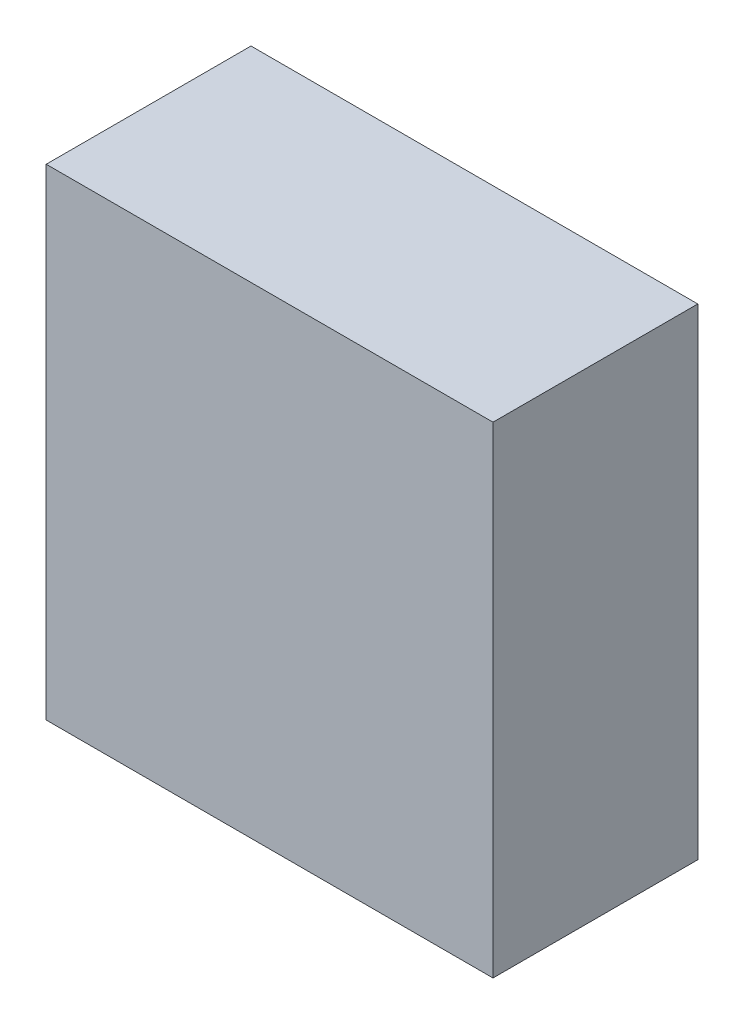
ISO-10303-21;
HEADER;
FILE_DESCRIPTION(('STEP AP214'),'2;1');
FILE_NAME('part.step','',(''),(''),'','','');
FILE_SCHEMA(('AUTOMOTIVE_DESIGN { 1 0 10303 214 1 1 1 1 }'));
ENDSEC;
DATA;
#1=APPLICATION_CONTEXT('core data for automotive mechanical design processes');
#2=APPLICATION_PROTOCOL_DEFINITION('international standard','automotive_design',2000,#1);
#3=PRODUCT_CONTEXT('',#1,'mechanical');
#4=PRODUCT('Part','Part','',(#3));
#5=PRODUCT_RELATED_PRODUCT_CATEGORY('part','',(#4));
#6=PRODUCT_DEFINITION_FORMATION('','',#4);
#7=PRODUCT_DEFINITION_CONTEXT('part definition',#1,'design');
#8=PRODUCT_DEFINITION('design','',#6,#7);
#9=PRODUCT_DEFINITION_SHAPE('','',#8);
#10=(LENGTH_UNIT() NAMED_UNIT(*) SI_UNIT(.MILLI.,.METRE.));
#11=(NAMED_UNIT(*) PLANE_ANGLE_UNIT() SI_UNIT($,.RADIAN.));
#12=(NAMED_UNIT(*) SI_UNIT($,.STERADIAN.) SOLID_ANGLE_UNIT());
#13=UNCERTAINTY_MEASURE_WITH_UNIT(LENGTH_MEASURE(1.E-05),#10,'distance_accuracy_value','');
#14=(GEOMETRIC_REPRESENTATION_CONTEXT(3) GLOBAL_UNCERTAINTY_ASSIGNED_CONTEXT((#13)) GLOBAL_UNIT_ASSIGNED_CONTEXT((#10,
#11,#12)) REPRESENTATION_CONTEXT('',''));
#15=CARTESIAN_POINT('',(0.,0.,0.));
#16=DIRECTION('',(0.,0.,1.));
#17=DIRECTION('',(1.,0.,0.));
#18=AXIS2_PLACEMENT_3D('',#15,#16,#17);
#19=CARTESIAN_POINT('',(0.,0.,77.));
#20=DIRECTION('',(1.,0.,0.));
#21=DIRECTION('',(0.,1.,0.));
#22=AXIS2_PLACEMENT_3D('',#19,#20,#21);
#23=PLANE('',#22);
#24=DIRECTION('',(0.,-1.,0.));
#25=VECTOR('',#24,1.);
#26=CARTESIAN_POINT('',(0.,0.,0.));
#27=LINE('',#26,#25);
#28=CARTESIAN_POINT('',(0.,0.,0.));
#29=VERTEX_POINT('',#28);
#30=CARTESIAN_POINT('',(0.,-181.,0.));
#31=VERTEX_POINT('',#30);
#32=EDGE_CURVE('E107',#29,#31,#27,.T.);
#33=ORIENTED_EDGE('',*,*,#32,.T.);
#34=DIRECTION('',(0.,0.,-1.));
#35=VECTOR('',#34,1.);
#36=CARTESIAN_POINT('',(0.,-181.,77.));
#37=LINE('',#36,#35);
#38=CARTESIAN_POINT('',(0.,-181.,77.));
#39=VERTEX_POINT('',#38);
#40=EDGE_CURVE('E11',#39,#31,#37,.T.);
#41=ORIENTED_EDGE('',*,*,#40,.F.);
#42=DIRECTION('',(0.,-1.,0.));
#43=VECTOR('',#42,1.);
#44=CARTESIAN_POINT('',(0.,0.,77.));
#45=LINE('',#44,#43);
#46=CARTESIAN_POINT('',(0.,0.,77.));
#47=VERTEX_POINT('',#46);
#48=EDGE_CURVE('E91',#47,#39,#45,.T.);
#49=ORIENTED_EDGE('',*,*,#48,.F.);
#50=DIRECTION('',(0.,0.,-1.));
#51=VECTOR('',#50,1.);
#52=CARTESIAN_POINT('',(0.,0.,77.));
#53=LINE('',#52,#51);
#54=EDGE_CURVE('E103',#47,#29,#53,.T.);
#55=ORIENTED_EDGE('',*,*,#54,.T.);
#56=EDGE_LOOP('',(#33,#41,#49,#55));
#57=FACE_BOUND('',#56,.T.);
#58=ADVANCED_FACE('F39',(#57),#23,.F.);
#59=CARTESIAN_POINT('',(0.,-181.,77.));
#60=DIRECTION('',(0.,1.,0.));
#61=DIRECTION('',(0.,0.,1.));
#62=AXIS2_PLACEMENT_3D('',#59,#60,#61);
#63=PLANE('',#62);
#64=DIRECTION('',(1.,0.,0.));
#65=VECTOR('',#64,1.);
#66=CARTESIAN_POINT('',(0.,-181.,0.));
#67=LINE('',#66,#65);
#68=CARTESIAN_POINT('',(168.,-181.,0.));
#69=VERTEX_POINT('',#68);
#70=EDGE_CURVE('E96',#31,#69,#67,.T.);
#71=ORIENTED_EDGE('',*,*,#70,.T.);
#72=DIRECTION('',(0.,0.,-1.));
#73=VECTOR('',#72,1.);
#74=CARTESIAN_POINT('',(168.,-181.,77.));
#75=LINE('',#74,#73);
#76=CARTESIAN_POINT('',(168.,-181.,77.));
#77=VERTEX_POINT('',#76);
#78=EDGE_CURVE('E48',#77,#69,#75,.T.);
#79=ORIENTED_EDGE('',*,*,#78,.F.);
#80=DIRECTION('',(1.,0.,0.));
#81=VECTOR('',#80,1.);
#82=CARTESIAN_POINT('',(0.,-181.,77.));
#83=LINE('',#82,#81);
#84=EDGE_CURVE('E86',#39,#77,#83,.T.);
#85=ORIENTED_EDGE('',*,*,#84,.F.);
#86=ORIENTED_EDGE('',*,*,#40,.T.);
#87=EDGE_LOOP('',(#71,#79,#85,#86));
#88=FACE_BOUND('',#87,.T.);
#89=ADVANCED_FACE('F95',(#88),#63,.F.);
#90=CARTESIAN_POINT('',(168.,0.,77.));
#91=DIRECTION('',(-1.,0.,0.));
#92=DIRECTION('',(0.,-1.,0.));
#93=AXIS2_PLACEMENT_3D('',#90,#91,#92);
#94=PLANE('',#93);
#95=DIRECTION('',(0.,1.,0.));
#96=VECTOR('',#95,1.);
#97=CARTESIAN_POINT('',(168.,0.,0.));
#98=LINE('',#97,#96);
#99=CARTESIAN_POINT('',(168.,0.,0.));
#100=VERTEX_POINT('',#99);
#101=EDGE_CURVE('E73',#69,#100,#98,.T.);
#102=ORIENTED_EDGE('',*,*,#101,.T.);
#103=DIRECTION('',(0.,0.,-1.));
#104=VECTOR('',#103,1.);
#105=CARTESIAN_POINT('',(168.,0.,77.));
#106=LINE('',#105,#104);
#107=CARTESIAN_POINT('',(168.,0.,77.));
#108=VERTEX_POINT('',#107);
#109=EDGE_CURVE('E98',#108,#100,#106,.T.);
#110=ORIENTED_EDGE('',*,*,#109,.F.);
#111=DIRECTION('',(0.,1.,0.));
#112=VECTOR('',#111,1.);
#113=CARTESIAN_POINT('',(168.,0.,77.));
#114=LINE('',#113,#112);
#115=EDGE_CURVE('E89',#77,#108,#114,.T.);
#116=ORIENTED_EDGE('',*,*,#115,.F.);
#117=ORIENTED_EDGE('',*,*,#78,.T.);
#118=EDGE_LOOP('',(#102,#110,#116,#117));
#119=FACE_BOUND('',#118,.T.);
#120=ADVANCED_FACE('F99',(#119),#94,.F.);
#121=CARTESIAN_POINT('',(0.,0.,77.));
#122=DIRECTION('',(0.,-1.,0.));
#123=DIRECTION('',(0.,0.,-1.));
#124=AXIS2_PLACEMENT_3D('',#121,#122,#123);
#125=PLANE('',#124);
#126=DIRECTION('',(-1.,0.,0.));
#127=VECTOR('',#126,1.);
#128=CARTESIAN_POINT('',(0.,0.,0.));
#129=LINE('',#128,#127);
#130=EDGE_CURVE('E79',#100,#29,#129,.T.);
#131=ORIENTED_EDGE('',*,*,#130,.T.);
#132=ORIENTED_EDGE('',*,*,#54,.F.);
#133=DIRECTION('',(-1.,0.,0.));
#134=VECTOR('',#133,1.);
#135=CARTESIAN_POINT('',(0.,0.,77.));
#136=LINE('',#135,#134);
#137=EDGE_CURVE('E56',#108,#47,#136,.T.);
#138=ORIENTED_EDGE('',*,*,#137,.F.);
#139=ORIENTED_EDGE('',*,*,#109,.T.);
#140=EDGE_LOOP('',(#131,#132,#138,#139));
#141=FACE_BOUND('',#140,.T.);
#142=ADVANCED_FACE('F120',(#141),#125,.F.);
#143=CARTESIAN_POINT('',(0.,0.,77.));
#144=DIRECTION('',(0.,0.,1.));
#145=DIRECTION('',(1.,0.,0.));
#146=AXIS2_PLACEMENT_3D('',#143,#144,#145);
#147=PLANE('',#146);
#148=ORIENTED_EDGE('',*,*,#48,.T.);
#149=ORIENTED_EDGE('',*,*,#84,.T.);
#150=ORIENTED_EDGE('',*,*,#115,.T.);
#151=ORIENTED_EDGE('',*,*,#137,.T.);
#152=EDGE_LOOP('',(#148,#149,#150,#151));
#153=FACE_BOUND('',#152,.T.);
#154=ADVANCED_FACE('F87',(#153),#147,.T.);
#155=CARTESIAN_POINT('',(0.,0.,0.));
#156=DIRECTION('',(0.,0.,1.));
#157=DIRECTION('',(1.,0.,0.));
#158=AXIS2_PLACEMENT_3D('',#155,#156,#157);
#159=PLANE('',#158);
#160=ORIENTED_EDGE('',*,*,#32,.F.);
#161=ORIENTED_EDGE('',*,*,#130,.F.);
#162=ORIENTED_EDGE('',*,*,#101,.F.);
#163=ORIENTED_EDGE('',*,*,#70,.F.);
#164=EDGE_LOOP('',(#160,#161,#162,#163));
#165=FACE_BOUND('',#164,.T.);
#166=ADVANCED_FACE('F123',(#165),#159,.F.);
#167=CLOSED_SHELL('',(#58,#89,#120,#142,#154,#166));
#168=MANIFOLD_SOLID_BREP('B2',#167);
#169=ADVANCED_BREP_SHAPE_REPRESENTATION('',(#18,#168),#14);
#170=SHAPE_DEFINITION_REPRESENTATION(#9,#169);
ENDSEC;
END-ISO-10303-21;
